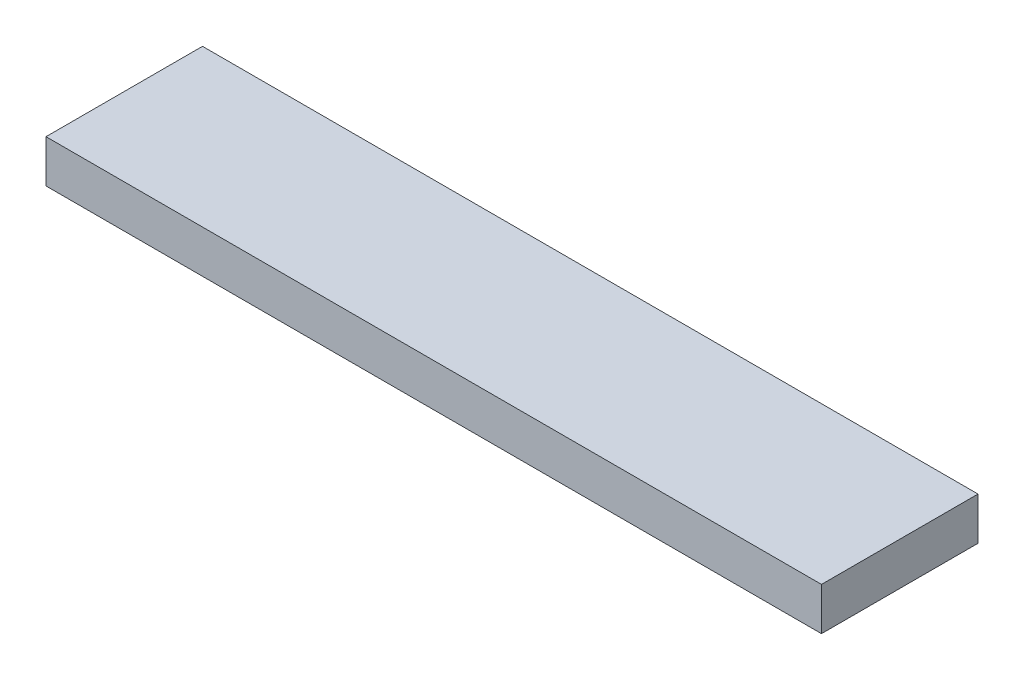
ISO-10303-21;
HEADER;
FILE_DESCRIPTION(('STEP AP214'),'2;1');
FILE_NAME('part.step','',(''),(''),'','','');
FILE_SCHEMA(('AUTOMOTIVE_DESIGN { 1 0 10303 214 1 1 1 1 }'));
ENDSEC;
DATA;
#1=APPLICATION_CONTEXT('core data for automotive mechanical design processes');
#2=APPLICATION_PROTOCOL_DEFINITION('international standard','automotive_design',2000,#1);
#3=PRODUCT_CONTEXT('',#1,'mechanical');
#4=PRODUCT('Part','Part','',(#3));
#5=PRODUCT_RELATED_PRODUCT_CATEGORY('part','',(#4));
#6=PRODUCT_DEFINITION_FORMATION('','',#4);
#7=PRODUCT_DEFINITION_CONTEXT('part definition',#1,'design');
#8=PRODUCT_DEFINITION('design','',#6,#7);
#9=PRODUCT_DEFINITION_SHAPE('','',#8);
#10=(LENGTH_UNIT() NAMED_UNIT(*) SI_UNIT(.MILLI.,.METRE.));
#11=(NAMED_UNIT(*) PLANE_ANGLE_UNIT() SI_UNIT($,.RADIAN.));
#12=(NAMED_UNIT(*) SI_UNIT($,.STERADIAN.) SOLID_ANGLE_UNIT());
#13=UNCERTAINTY_MEASURE_WITH_UNIT(LENGTH_MEASURE(1.E-05),#10,'distance_accuracy_value','');
#14=(GEOMETRIC_REPRESENTATION_CONTEXT(3) GLOBAL_UNCERTAINTY_ASSIGNED_CONTEXT((#13)) GLOBAL_UNIT_ASSIGNED_CONTEXT((#10,
#11,#12)) REPRESENTATION_CONTEXT('',''));
#15=CARTESIAN_POINT('',(0.,0.,0.));
#16=DIRECTION('',(0.,0.,1.));
#17=DIRECTION('',(1.,0.,0.));
#18=AXIS2_PLACEMENT_3D('',#15,#16,#17);
#19=CARTESIAN_POINT('',(0.,38.1,0.));
#20=DIRECTION('',(1.,0.,0.));
#21=DIRECTION('',(0.,0.,-1.));
#22=AXIS2_PLACEMENT_3D('',#19,#20,#21);
#23=PLANE('',#22);
#24=DIRECTION('',(0.,0.,1.));
#25=VECTOR('',#24,1.);
#26=CARTESIAN_POINT('',(0.,0.,0.));
#27=LINE('',#26,#25);
#28=CARTESIAN_POINT('',(0.,0.,-139.7));
#29=VERTEX_POINT('',#28);
#30=CARTESIAN_POINT('',(0.,0.,0.));
#31=VERTEX_POINT('',#30);
#32=EDGE_CURVE('E93',#29,#31,#27,.T.);
#33=ORIENTED_EDGE('',*,*,#32,.T.);
#34=DIRECTION('',(0.,-1.,0.));
#35=VECTOR('',#34,1.);
#36=CARTESIAN_POINT('',(0.,38.1,0.));
#37=LINE('',#36,#35);
#38=CARTESIAN_POINT('',(0.,38.1,0.));
#39=VERTEX_POINT('',#38);
#40=EDGE_CURVE('E11',#39,#31,#37,.T.);
#41=ORIENTED_EDGE('',*,*,#40,.F.);
#42=DIRECTION('',(0.,0.,1.));
#43=VECTOR('',#42,1.);
#44=CARTESIAN_POINT('',(0.,38.1,0.));
#45=LINE('',#44,#43);
#46=CARTESIAN_POINT('',(0.,38.1,-139.7));
#47=VERTEX_POINT('',#46);
#48=EDGE_CURVE('E81',#47,#39,#45,.T.);
#49=ORIENTED_EDGE('',*,*,#48,.F.);
#50=DIRECTION('',(0.,-1.,0.));
#51=VECTOR('',#50,1.);
#52=CARTESIAN_POINT('',(0.,38.1,-139.7));
#53=LINE('',#52,#51);
#54=EDGE_CURVE('E89',#47,#29,#53,.T.);
#55=ORIENTED_EDGE('',*,*,#54,.T.);
#56=EDGE_LOOP('',(#33,#41,#49,#55));
#57=FACE_BOUND('',#56,.T.);
#58=ADVANCED_FACE('F30',(#57),#23,.F.);
#59=CARTESIAN_POINT('',(0.,38.1,0.));
#60=DIRECTION('',(0.,0.,-1.));
#61=DIRECTION('',(-1.,0.,0.));
#62=AXIS2_PLACEMENT_3D('',#59,#60,#61);
#63=PLANE('',#62);
#64=DIRECTION('',(1.,0.,0.));
#65=VECTOR('',#64,1.);
#66=CARTESIAN_POINT('',(0.,0.,0.));
#67=LINE('',#66,#65);
#68=CARTESIAN_POINT('',(692.15,0.,0.));
#69=VERTEX_POINT('',#68);
#70=EDGE_CURVE('E85',#31,#69,#67,.T.);
#71=ORIENTED_EDGE('',*,*,#70,.T.);
#72=DIRECTION('',(0.,-1.,0.));
#73=VECTOR('',#72,1.);
#74=CARTESIAN_POINT('',(692.15,38.1,0.));
#75=LINE('',#74,#73);
#76=CARTESIAN_POINT('',(692.15,38.1,0.));
#77=VERTEX_POINT('',#76);
#78=EDGE_CURVE('E38',#77,#69,#75,.T.);
#79=ORIENTED_EDGE('',*,*,#78,.F.);
#80=DIRECTION('',(1.,0.,0.));
#81=VECTOR('',#80,1.);
#82=CARTESIAN_POINT('',(0.,38.1,0.));
#83=LINE('',#82,#81);
#84=EDGE_CURVE('E76',#39,#77,#83,.T.);
#85=ORIENTED_EDGE('',*,*,#84,.F.);
#86=ORIENTED_EDGE('',*,*,#40,.T.);
#87=EDGE_LOOP('',(#71,#79,#85,#86));
#88=FACE_BOUND('',#87,.T.);
#89=ADVANCED_FACE('F84',(#88),#63,.F.);
#90=CARTESIAN_POINT('',(692.15,38.1,0.));
#91=DIRECTION('',(-1.,0.,0.));
#92=DIRECTION('',(0.,0.,1.));
#93=AXIS2_PLACEMENT_3D('',#90,#91,#92);
#94=PLANE('',#93);
#95=DIRECTION('',(0.,0.,-1.));
#96=VECTOR('',#95,1.);
#97=CARTESIAN_POINT('',(692.15,0.,0.));
#98=LINE('',#97,#96);
#99=CARTESIAN_POINT('',(692.15,0.,-139.7));
#100=VERTEX_POINT('',#99);
#101=EDGE_CURVE('E63',#69,#100,#98,.T.);
#102=ORIENTED_EDGE('',*,*,#101,.T.);
#103=DIRECTION('',(0.,-1.,0.));
#104=VECTOR('',#103,1.);
#105=CARTESIAN_POINT('',(692.15,38.1,-139.7));
#106=LINE('',#105,#104);
#107=CARTESIAN_POINT('',(692.15,38.1,-139.7));
#108=VERTEX_POINT('',#107);
#109=EDGE_CURVE('E86',#108,#100,#106,.T.);
#110=ORIENTED_EDGE('',*,*,#109,.F.);
#111=DIRECTION('',(0.,0.,-1.));
#112=VECTOR('',#111,1.);
#113=CARTESIAN_POINT('',(692.15,38.1,0.));
#114=LINE('',#113,#112);
#115=EDGE_CURVE('E79',#77,#108,#114,.T.);
#116=ORIENTED_EDGE('',*,*,#115,.F.);
#117=ORIENTED_EDGE('',*,*,#78,.T.);
#118=EDGE_LOOP('',(#102,#110,#116,#117));
#119=FACE_BOUND('',#118,.T.);
#120=ADVANCED_FACE('F87',(#119),#94,.F.);
#121=CARTESIAN_POINT('',(0.,38.1,-139.7));
#122=DIRECTION('',(0.,0.,1.));
#123=DIRECTION('',(1.,0.,0.));
#124=AXIS2_PLACEMENT_3D('',#121,#122,#123);
#125=PLANE('',#124);
#126=DIRECTION('',(-1.,0.,0.));
#127=VECTOR('',#126,1.);
#128=CARTESIAN_POINT('',(0.,0.,-139.7));
#129=LINE('',#128,#127);
#130=EDGE_CURVE('E69',#100,#29,#129,.T.);
#131=ORIENTED_EDGE('',*,*,#130,.T.);
#132=ORIENTED_EDGE('',*,*,#54,.F.);
#133=DIRECTION('',(-1.,0.,0.));
#134=VECTOR('',#133,1.);
#135=CARTESIAN_POINT('',(0.,38.1,-139.7));
#136=LINE('',#135,#134);
#137=EDGE_CURVE('E46',#108,#47,#136,.T.);
#138=ORIENTED_EDGE('',*,*,#137,.F.);
#139=ORIENTED_EDGE('',*,*,#109,.T.);
#140=EDGE_LOOP('',(#131,#132,#138,#139));
#141=FACE_BOUND('',#140,.T.);
#142=ADVANCED_FACE('F100',(#141),#125,.F.);
#143=CARTESIAN_POINT('',(0.,38.1,-139.7));
#144=DIRECTION('',(0.,-1.,0.));
#145=DIRECTION('',(0.,0.,-1.));
#146=AXIS2_PLACEMENT_3D('',#143,#144,#145);
#147=PLANE('',#146);
#148=ORIENTED_EDGE('',*,*,#48,.T.);
#149=ORIENTED_EDGE('',*,*,#84,.T.);
#150=ORIENTED_EDGE('',*,*,#115,.T.);
#151=ORIENTED_EDGE('',*,*,#137,.T.);
#152=EDGE_LOOP('',(#148,#149,#150,#151));
#153=FACE_BOUND('',#152,.T.);
#154=ADVANCED_FACE('F77',(#153),#147,.F.);
#155=CARTESIAN_POINT('',(0.,0.,-139.7));
#156=DIRECTION('',(0.,-1.,0.));
#157=DIRECTION('',(0.,0.,-1.));
#158=AXIS2_PLACEMENT_3D('',#155,#156,#157);
#159=PLANE('',#158);
#160=ORIENTED_EDGE('',*,*,#32,.F.);
#161=ORIENTED_EDGE('',*,*,#130,.F.);
#162=ORIENTED_EDGE('',*,*,#101,.F.);
#163=ORIENTED_EDGE('',*,*,#70,.F.);
#164=EDGE_LOOP('',(#160,#161,#162,#163));
#165=FACE_BOUND('',#164,.T.);
#166=ADVANCED_FACE('F103',(#165),#159,.T.);
#167=CLOSED_SHELL('',(#58,#89,#120,#142,#154,#166));
#168=MANIFOLD_SOLID_BREP('B2',#167);
#169=ADVANCED_BREP_SHAPE_REPRESENTATION('',(#18,#168),#14);
#170=SHAPE_DEFINITION_REPRESENTATION(#9,#169);
ENDSEC;
END-ISO-10303-21;
